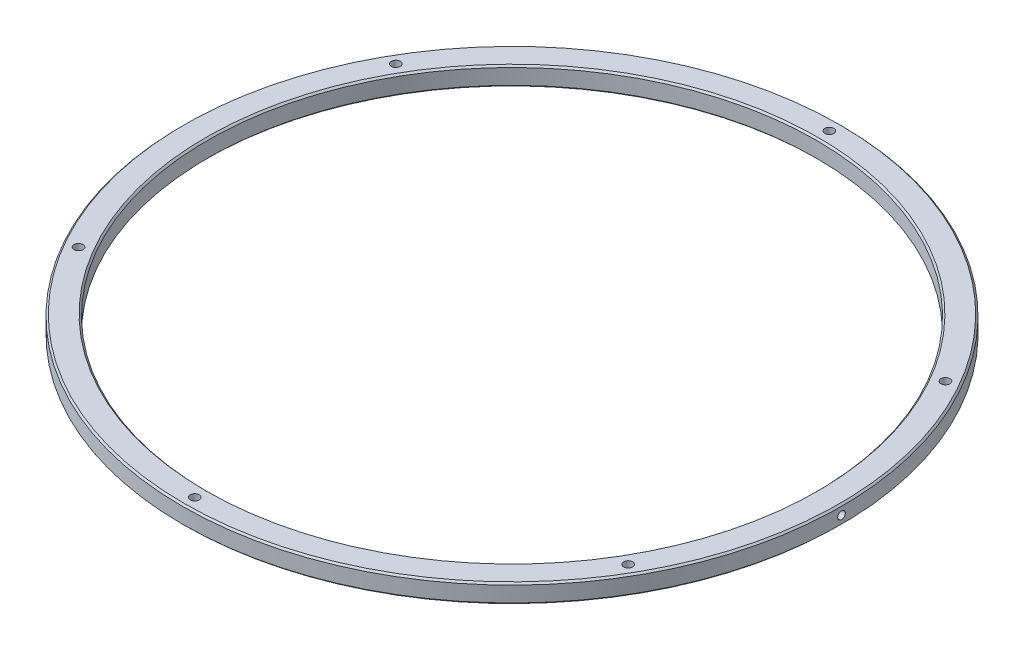
ISO-10303-21;
HEADER;
FILE_DESCRIPTION(('STEP AP214'),'2;1');
FILE_NAME('part.step','',(''),(''),'','','');
FILE_SCHEMA(('AUTOMOTIVE_DESIGN { 1 0 10303 214 1 1 1 1 }'));
ENDSEC;
DATA;
#1=APPLICATION_CONTEXT('core data for automotive mechanical design processes');
#2=APPLICATION_PROTOCOL_DEFINITION('international standard','automotive_design',2000,#1);
#3=PRODUCT_CONTEXT('',#1,'mechanical');
#4=PRODUCT('Part','Part','',(#3));
#5=PRODUCT_RELATED_PRODUCT_CATEGORY('part','',(#4));
#6=PRODUCT_DEFINITION_FORMATION('','',#4);
#7=PRODUCT_DEFINITION_CONTEXT('part definition',#1,'design');
#8=PRODUCT_DEFINITION('design','',#6,#7);
#9=PRODUCT_DEFINITION_SHAPE('','',#8);
#10=(LENGTH_UNIT() NAMED_UNIT(*) SI_UNIT(.MILLI.,.METRE.));
#11=(NAMED_UNIT(*) PLANE_ANGLE_UNIT() SI_UNIT($,.RADIAN.));
#12=(NAMED_UNIT(*) SI_UNIT($,.STERADIAN.) SOLID_ANGLE_UNIT());
#13=UNCERTAINTY_MEASURE_WITH_UNIT(LENGTH_MEASURE(1.E-05),#10,'distance_accuracy_value','');
#14=(GEOMETRIC_REPRESENTATION_CONTEXT(3) GLOBAL_UNCERTAINTY_ASSIGNED_CONTEXT((#13)) GLOBAL_UNIT_ASSIGNED_CONTEXT((#10,
#11,#12)) REPRESENTATION_CONTEXT('',''));
#15=CARTESIAN_POINT('',(0.,0.,0.));
#16=DIRECTION('',(0.,0.,1.));
#17=DIRECTION('',(1.,0.,0.));
#18=AXIS2_PLACEMENT_3D('',#15,#16,#17);
#19=CARTESIAN_POINT('',(0.,10.,0.));
#20=DIRECTION('',(0.,-1.,0.));
#21=DIRECTION('',(0.,0.,-1.));
#22=AXIS2_PLACEMENT_3D('',#19,#20,#21);
#23=CYLINDRICAL_SURFACE('',#22,175.);
#24=CARTESIAN_POINT('',(0.,0.888999999999973,0.));
#25=DIRECTION('',(0.,1.,0.));
#26=DIRECTION('',(0.,0.,1.));
#27=AXIS2_PLACEMENT_3D('',#24,#25,#26);
#28=CIRCLE('',#27,175.);
#29=CARTESIAN_POINT('',(0.,0.888999999999973,175.));
#30=VERTEX_POINT('',#29);
#31=EDGE_CURVE('E10',#30,#30,#28,.T.);
#32=ORIENTED_EDGE('',*,*,#31,.T.);
#33=EDGE_LOOP('',(#32));
#34=FACE_BOUND('',#33,.T.);
#35=CARTESIAN_POINT('',(0.,9.11100000000003,0.));
#36=DIRECTION('',(0.,1.,0.));
#37=DIRECTION('',(0.,0.,1.));
#38=AXIS2_PLACEMENT_3D('',#35,#36,#37);
#39=CIRCLE('',#38,175.);
#40=CARTESIAN_POINT('',(0.,9.11100000000003,-175.));
#41=VERTEX_POINT('',#40);
#42=EDGE_CURVE('E51',#41,#41,#39,.F.);
#43=ORIENTED_EDGE('',*,*,#42,.T.);
#44=EDGE_LOOP('',(#43));
#45=FACE_BOUND('',#44,.T.);
#46=CARTESIAN_POINT('',(174.98820239238,4.99928134064787,-2.03199987291553));
#47=CARTESIAN_POINT('',(174.988202570209,4.88479531172114,-2.03199365923341));
#48=CARTESIAN_POINT('',(174.988321210938,4.77023251183511,-2.02184241964528));
#49=CARTESIAN_POINT('',(174.988771961684,4.54427467390271,-1.98243708763626));
#50=CARTESIAN_POINT('',(174.98910454192,4.43288717945389,-1.95314091408695));
#51=CARTESIAN_POINT('',(174.989941765229,4.21664529370118,-1.87663009054582));
#52=CARTESIAN_POINT('',(174.990446146028,4.11178123053976,-1.82944274109848));
#53=CARTESIAN_POINT('',(174.991572227382,3.91138486214241,-1.71834747851327));
#54=CARTESIAN_POINT('',(174.992193793931,3.81584208519371,-1.65445863223467));
#55=CARTESIAN_POINT('',(174.99316705951,3.68135003597958,-1.54686159015817));
#56=CARTESIAN_POINT('',(174.993500152058,3.63778542503404,-1.5088048170447));
#57=CARTESIAN_POINT('',(174.994170036959,3.55417760604364,-1.42900315304231));
#58=CARTESIAN_POINT('',(174.994506829248,3.51413433792167,-1.38725832509912));
#59=CARTESIAN_POINT('',(174.995507056759,3.39969346954507,-1.25698561559439));
#60=CARTESIAN_POINT('',(174.996160655738,3.33094352858026,-1.16338638576851));
#61=CARTESIAN_POINT('',(174.997343785933,3.21197657746896,-0.968949344246464));
#62=CARTESIAN_POINT('',(174.997876379067,3.16127762878772,-0.868402177204877));
#63=CARTESIAN_POINT('',(174.998784832444,3.07673799937918,-0.660368849450822));
#64=CARTESIAN_POINT('',(174.999160689881,3.04289762033697,-0.552882564601315));
#65=CARTESIAN_POINT('',(174.99958205427,3.00519772124178,-0.386691740485421));
#66=CARTESIAN_POINT('',(174.999699492169,2.9947474844399,-0.329406812700526));
#67=CARTESIAN_POINT('',(174.9998784535,2.97882602162202,-0.214135140119631));
#68=CARTESIAN_POINT('',(174.999939980293,2.97335449638739,-0.156148437712286));
#69=CARTESIAN_POINT('',(175.000005086831,2.96755421319917,-0.0399459595556265));
#70=CARTESIAN_POINT('',(175.000008694774,2.96722295265631,0.0182696909179335));
#71=CARTESIAN_POINT('',(174.999957967073,2.97179896147085,0.134493870431488));
#72=CARTESIAN_POINT('',(174.999903631396,2.97670623386845,0.19250239935126));
#73=CARTESIAN_POINT('',(174.99974196756,2.99124004105372,0.305579832220002));
#74=CARTESIAN_POINT('',(174.999636829018,3.00067147107204,0.36067400748078));
#75=CARTESIAN_POINT('',(174.999377673265,3.02399673059137,0.469896537800808));
#76=CARTESIAN_POINT('',(174.999223655767,3.0378905863673,0.524024887171257));
#77=CARTESIAN_POINT('',(174.998693720698,3.08605613098121,0.684551753002757));
#78=CARTESIAN_POINT('',(174.998249952503,3.12680904830388,0.789071325159671));
#79=CARTESIAN_POINT('',(174.997205808091,3.22650591426776,0.994454532327489));
#80=CARTESIAN_POINT('',(174.99659972568,3.2861310492342,1.09498938919473));
#81=CARTESIAN_POINT('',(174.995635073546,3.38769308566503,1.23691603530736));
#82=CARTESIAN_POINT('',(174.995304308493,3.42356309391825,1.28274097883027));
#83=CARTESIAN_POINT('',(174.994634773728,3.49923268312198,1.37103769102855));
#84=CARTESIAN_POINT('',(174.994296004978,3.5390317928861,1.41350986067917));
#85=CARTESIAN_POINT('',(174.993629511773,3.62124717245,1.49372134065822));
#86=CARTESIAN_POINT('',(174.993301720397,3.6635751707496,1.53155126382363));
#87=CARTESIAN_POINT('',(174.992657320357,3.75127024105599,1.60348850065141));
#88=CARTESIAN_POINT('',(174.992340712799,3.79663761204991,1.63759544720933));
#89=CARTESIAN_POINT('',(174.991419874102,3.93686685571029,1.73410688135205));
#90=CARTESIAN_POINT('',(174.990844783648,4.03583715737115,1.79068386409452));
#91=CARTESIAN_POINT('',(174.98983192862,4.24204865375978,1.88707742775803));
#92=CARTESIAN_POINT('',(174.989394751567,4.34932287231249,1.92682254303988));
#93=CARTESIAN_POINT('',(174.988710226764,4.56895990518529,1.98802557957096));
#94=CARTESIAN_POINT('',(174.98846270593,4.6813179804679,2.00950017675126));
#95=CARTESIAN_POINT('',(174.988257173056,4.85201395639353,2.02728171498364));
#96=CARTESIAN_POINT('',(174.988216595273,4.90967828219293,2.03077672020764));
#97=CARTESIAN_POINT('',(174.98819447176,5.02509110364189,2.03268198510316));
#98=CARTESIAN_POINT('',(174.988212925491,5.08283959851632,2.03109229130902));
#99=CARTESIAN_POINT('',(174.988355753599,5.25557714957616,2.01877561547303));
#100=CARTESIAN_POINT('',(174.988567536179,5.37010778184744,2.00050610776576));
#101=CARTESIAN_POINT('',(174.989184259815,5.59132945514331,1.94578958326098));
#102=CARTESIAN_POINT('',(174.989583786324,5.69814902972441,1.90985088128677));
#103=CARTESIAN_POINT('',(174.990528674178,5.90458319030026,1.82121900058679));
#104=CARTESIAN_POINT('',(174.991074025107,6.00419829018412,1.76852701830801));
#105=CARTESIAN_POINT('',(174.992276348689,6.19692837471479,1.64533660114592));
#106=CARTESIAN_POINT('',(174.992936607636,6.28968501260456,1.57427031859738));
#107=CARTESIAN_POINT('',(174.993944361538,6.41826787717164,1.45635748449379));
#108=CARTESIAN_POINT('',(174.994283271507,6.45938022645378,1.41515445805689));
#109=CARTESIAN_POINT('',(174.994956743324,6.5377979066013,1.32927150113451));
#110=CARTESIAN_POINT('',(174.995291305039,6.57510312237866,1.28459146561247));
#111=CARTESIAN_POINT('',(174.996248386346,6.67844408619214,1.14932426752016));
#112=CARTESIAN_POINT('',(174.996850666145,6.73909474521977,1.054540290491));
#113=CARTESIAN_POINT('',(174.997932587279,6.8442792182308,0.856400700453925));
#114=CARTESIAN_POINT('',(174.998412132736,6.88880044325392,0.753038469150343));
#115=CARTESIAN_POINT('',(174.999210577482,6.96176199306666,0.536964713177678));
#116=CARTESIAN_POINT('',(174.999523700867,6.98962787711477,0.424057856247075));
#117=CARTESIAN_POINT('',(174.999928436711,7.02563245802375,0.195218692623221));
#118=CARTESIAN_POINT('',(175.00002028153,7.03379184833555,0.0792896888947458));
#119=CARTESIAN_POINT('',(174.99997260007,7.02957404256514,-0.149913062620454));
#120=CARTESIAN_POINT('',(174.999837560021,7.01759504328081,-0.263194428542191));
#121=CARTESIAN_POINT('',(174.999360001172,6.97496827173031,-0.486276424088285));
#122=CARTESIAN_POINT('',(174.999017252512,6.94429981658459,-0.596073055466022));
#123=CARTESIAN_POINT('',(174.998160118531,6.86532386841745,-0.809570049710768));
#124=CARTESIAN_POINT('',(174.997645101535,6.81695139557708,-0.913246299604544));
#125=CARTESIAN_POINT('',(174.996500179563,6.70378030865486,-1.11117189581382));
#126=CARTESIAN_POINT('',(174.995870387887,6.63899786934334,-1.2054303980608));
#127=CARTESIAN_POINT('',(174.994889550013,6.53007320344681,-1.33815027913542));
#128=CARTESIAN_POINT('',(174.9945538282,6.49145967167629,-1.381245381003));
#129=CARTESIAN_POINT('',(174.993882475156,6.41053290206212,-1.46383000323183));
#130=CARTESIAN_POINT('',(174.993546843922,6.36821978670842,-1.50331964287833));
#131=CARTESIAN_POINT('',(174.992885411739,6.28025063865243,-1.57843923556556));
#132=CARTESIAN_POINT('',(174.992559617862,6.23459227783856,-1.61406645697988));
#133=CARTESIAN_POINT('',(174.991926686455,6.14041027581037,-1.68128577081351));
#134=CARTESIAN_POINT('',(174.991619550126,6.09188645028422,-1.71287760325506));
#135=CARTESIAN_POINT('',(174.9907580327,5.94592068830775,-1.79940857291377));
#136=CARTESIAN_POINT('',(174.990240008058,5.84503636296602,-1.84866569100735));
#137=CARTESIAN_POINT('',(174.989357133785,5.63684519443047,-1.93043268311156));
#138=CARTESIAN_POINT('',(174.988992103033,5.52954611830843,-1.96296237019446));
#139=CARTESIAN_POINT('',(174.98855423983,5.3512181421963,-2.00152324765041));
#140=CARTESIAN_POINT('',(174.988423346514,5.28131221847808,-2.01289688540128));
#141=CARTESIAN_POINT('',(174.988247384998,5.1407075248009,-2.02813561795394));
#142=CARTESIAN_POINT('',(174.98820228252,5.07000908285774,-2.03200371163464));
#143=CARTESIAN_POINT('',(174.98820239238,4.99928134064787,-2.03199987291553));
#144=B_SPLINE_CURVE_WITH_KNOTS('',3,(#46,#47,#48,#49,#50,#51,#52,#53,#54,#55,#56,#57,#58,#59,
#60,#61,#62,#63,#64,#65,#66,#67,#68,#69,#70,#71,#72,#73,#74,#75,#76,#77,#78,#79,#80,#81,#82,#83,
#84,#85,#86,#87,#88,#89,#90,#91,#92,#93,#94,#95,#96,#97,#98,#99,#100,#101,#102,#103,#104,#105,
#106,#107,#108,#109,#110,#111,#112,#113,#114,#115,#116,#117,#118,#119,#120,#121,#122,#123,#124,
#125,#126,#127,#128,#129,#130,#131,#132,#133,#134,#135,#136,#137,#138,#139,#140,#141,#142,#143),
.UNSPECIFIED.,.T.,.F.,(4,2,2,2,2,2,2,2,2,2,2,2,2,2,2,2,2,2,2,2,2,2,2,2,2,2,2,2,2,2,2,2,2,2,2,2,
2,2,2,2,2,2,2,2,2,2,2,2,4),(0.,0.343203024374381,0.687162967972575,1.03060015406831,
1.3736469627809,1.54699333720159,1.72033675361126,2.06686700732383,2.4032929940128,
2.7397250008482,2.91423781342216,3.08874013715112,3.26315750001154,3.43757496409544,
3.60506751717012,3.77256105646538,4.10761022604327,4.45648356128204,4.63088091774184,
4.80525738543826,4.97535164454954,5.14546266069829,5.48576179674183,5.82749164887424,
6.16890926050828,6.34202601661064,6.51514118838096,6.86122428458129,7.19788724027286,
7.53452615834732,7.88316661460126,8.0575849727224,8.23200860187507,8.5679538475351,
8.90416073512244,9.25137909667569,9.59823269135521,9.93830829930205,10.2787609406056,
10.6204759008233,10.9618553454969,11.1352588155618,11.3086565465628,11.4821761208346,
11.6557068683789,11.9909696559526,12.3258344161332,12.5379448363353,12.749970489257),.UNSPECIFIED.);
#145=CARTESIAN_POINT('',(174.98820239238,4.99928134064787,-2.03199987291553));
#146=VERTEX_POINT('',#145);
#147=EDGE_CURVE('E84',#146,#146,#144,.F.);
#148=ORIENTED_EDGE('',*,*,#147,.F.);
#149=EDGE_LOOP('',(#148));
#150=FACE_BOUND('',#149,.T.);
#151=ADVANCED_FACE('F42',(#34,#45,#150),#23,.T.);
#152=CARTESIAN_POINT('',(0.,10.,0.));
#153=DIRECTION('',(0.,1.,0.));
#154=DIRECTION('',(0.,0.,1.));
#155=AXIS2_PLACEMENT_3D('',#152,#153,#154);
#156=PLANE('',#155);
#157=CARTESIAN_POINT('',(0.,10.,0.));
#158=DIRECTION('',(0.,1.,0.));
#159=DIRECTION('',(0.,0.,1.));
#160=AXIS2_PLACEMENT_3D('',#157,#158,#159);
#161=CIRCLE('',#160,162.554);
#162=CARTESIAN_POINT('',(0.,10.,162.554));
#163=VERTEX_POINT('',#162);
#164=EDGE_CURVE('E56',#163,#163,#161,.F.);
#165=ORIENTED_EDGE('',*,*,#164,.T.);
#166=EDGE_LOOP('',(#165));
#167=FACE_BOUND('',#166,.T.);
#168=CARTESIAN_POINT('',(0.,10.,0.));
#169=DIRECTION('',(0.,1.,0.));
#170=DIRECTION('',(0.,0.,1.));
#171=AXIS2_PLACEMENT_3D('',#168,#169,#170);
#172=CIRCLE('',#171,174.111);
#173=CARTESIAN_POINT('',(0.,10.,-174.111));
#174=VERTEX_POINT('',#173);
#175=EDGE_CURVE('E61',#174,#174,#172,.T.);
#176=ORIENTED_EDGE('',*,*,#175,.T.);
#177=EDGE_LOOP('',(#176));
#178=FACE_BOUND('',#177,.T.);
#179=CARTESIAN_POINT('',(-145.925280537693,10.,84.2499999999739));
#180=DIRECTION('',(0.,1.,0.));
#181=DIRECTION('',(0.,0.,1.));
#182=AXIS2_PLACEMENT_3D('',#179,#180,#181);
#183=CIRCLE('',#182,2.38124999997265);
#184=CARTESIAN_POINT('',(-145.925280537693,10.,86.6312499999465));
#185=VERTEX_POINT('',#184);
#186=EDGE_CURVE('E169',#185,#185,#183,.T.);
#187=ORIENTED_EDGE('',*,*,#186,.F.);
#188=EDGE_LOOP('',(#187));
#189=FACE_BOUND('',#188,.T.);
#190=CARTESIAN_POINT('',(145.92528053767,10.,84.2500000000131));
#191=DIRECTION('',(0.,1.,0.));
#192=DIRECTION('',(0.,0.,1.));
#193=AXIS2_PLACEMENT_3D('',#190,#191,#192);
#194=CIRCLE('',#193,2.38124999998634);
#195=CARTESIAN_POINT('',(145.92528053767,10.,86.6312499999994));
#196=VERTEX_POINT('',#195);
#197=EDGE_CURVE('E181',#196,#196,#194,.T.);
#198=ORIENTED_EDGE('',*,*,#197,.F.);
#199=EDGE_LOOP('',(#198));
#200=FACE_BOUND('',#199,.T.);
#201=CARTESIAN_POINT('',(0.,10.,-168.5));
#202=DIRECTION('',(0.,1.,0.));
#203=DIRECTION('',(0.,0.,1.));
#204=AXIS2_PLACEMENT_3D('',#201,#202,#203);
#205=CIRCLE('',#204,2.38125);
#206=CARTESIAN_POINT('',(0.,10.,-166.11875));
#207=VERTEX_POINT('',#206);
#208=EDGE_CURVE('E83',#207,#207,#205,.T.);
#209=ORIENTED_EDGE('',*,*,#208,.F.);
#210=EDGE_LOOP('',(#209));
#211=FACE_BOUND('',#210,.T.);
#212=CARTESIAN_POINT('',(145.925280537682,10.,-84.2499999999935));
#213=DIRECTION('',(0.,1.,0.));
#214=DIRECTION('',(0.,0.,1.));
#215=AXIS2_PLACEMENT_3D('',#212,#213,#214);
#216=CIRCLE('',#215,2.38124999999314);
#217=CARTESIAN_POINT('',(145.925280537682,10.,-81.8687500000003));
#218=VERTEX_POINT('',#217);
#219=EDGE_CURVE('E187',#218,#218,#216,.T.);
#220=ORIENTED_EDGE('',*,*,#219,.F.);
#221=EDGE_LOOP('',(#220));
#222=FACE_BOUND('',#221,.T.);
#223=CARTESIAN_POINT('',(-2.25777323230745E-11,10.,168.5));
#224=DIRECTION('',(0.,1.,0.));
#225=DIRECTION('',(0.,0.,1.));
#226=AXIS2_PLACEMENT_3D('',#223,#224,#225);
#227=CIRCLE('',#226,2.38124999997953);
#228=CARTESIAN_POINT('',(-2.25777323230745E-11,10.,170.88124999998));
#229=VERTEX_POINT('',#228);
#230=EDGE_CURVE('E175',#229,#229,#227,.T.);
#231=ORIENTED_EDGE('',*,*,#230,.F.);
#232=EDGE_LOOP('',(#231));
#233=FACE_BOUND('',#232,.T.);
#234=CARTESIAN_POINT('',(-145.925280537659,10.,-84.2500000000327));
#235=DIRECTION('',(0.,1.,0.));
#236=DIRECTION('',(0.,0.,1.));
#237=AXIS2_PLACEMENT_3D('',#234,#235,#236);
#238=CIRCLE('',#237,2.38124999996578);
#239=CARTESIAN_POINT('',(-145.925280537659,10.,-81.8687500000669));
#240=VERTEX_POINT('',#239);
#241=EDGE_CURVE('E162',#240,#240,#238,.T.);
#242=ORIENTED_EDGE('',*,*,#241,.F.);
#243=EDGE_LOOP('',(#242));
#244=FACE_BOUND('',#243,.T.);
#245=ADVANCED_FACE('F105',(#167,#178,#189,#200,#211,#222,#233,#244),#156,.T.);
#246=CARTESIAN_POINT('',(0.,0.,0.));
#247=DIRECTION('',(0.,1.,0.));
#248=DIRECTION('',(0.,0.,1.));
#249=AXIS2_PLACEMENT_3D('',#246,#247,#248);
#250=PLANE('',#249);
#251=CARTESIAN_POINT('',(0.,0.,0.));
#252=DIRECTION('',(0.,1.,0.));
#253=DIRECTION('',(0.,0.,1.));
#254=AXIS2_PLACEMENT_3D('',#251,#252,#253);
#255=CIRCLE('',#254,162.554);
#256=CARTESIAN_POINT('',(0.,0.,-162.554));
#257=VERTEX_POINT('',#256);
#258=EDGE_CURVE('E75',#257,#257,#255,.T.);
#259=ORIENTED_EDGE('',*,*,#258,.T.);
#260=EDGE_LOOP('',(#259));
#261=FACE_BOUND('',#260,.T.);
#262=CARTESIAN_POINT('',(0.,0.,0.));
#263=DIRECTION('',(0.,1.,0.));
#264=DIRECTION('',(0.,0.,1.));
#265=AXIS2_PLACEMENT_3D('',#262,#263,#264);
#266=CIRCLE('',#265,174.111);
#267=CARTESIAN_POINT('',(0.,0.,174.111));
#268=VERTEX_POINT('',#267);
#269=EDGE_CURVE('E79',#268,#268,#266,.F.);
#270=ORIENTED_EDGE('',*,*,#269,.T.);
#271=EDGE_LOOP('',(#270));
#272=FACE_BOUND('',#271,.T.);
#273=CARTESIAN_POINT('',(0.,0.,-168.5));
#274=DIRECTION('',(0.,1.,0.));
#275=DIRECTION('',(0.,0.,1.));
#276=AXIS2_PLACEMENT_3D('',#273,#274,#275);
#277=CIRCLE('',#276,2.38125);
#278=CARTESIAN_POINT('',(0.,0.,-166.11875));
#279=VERTEX_POINT('',#278);
#280=EDGE_CURVE('E95',#279,#279,#277,.T.);
#281=ORIENTED_EDGE('',*,*,#280,.T.);
#282=EDGE_LOOP('',(#281));
#283=FACE_BOUND('',#282,.T.);
#284=CARTESIAN_POINT('',(145.925280537682,0.,-84.2499999999935));
#285=DIRECTION('',(0.,1.,0.));
#286=DIRECTION('',(0.,0.,1.));
#287=AXIS2_PLACEMENT_3D('',#284,#285,#286);
#288=CIRCLE('',#287,2.38124999999314);
#289=CARTESIAN_POINT('',(145.925280537682,0.,-81.8687500000003));
#290=VERTEX_POINT('',#289);
#291=EDGE_CURVE('E145',#290,#290,#288,.T.);
#292=ORIENTED_EDGE('',*,*,#291,.T.);
#293=EDGE_LOOP('',(#292));
#294=FACE_BOUND('',#293,.T.);
#295=CARTESIAN_POINT('',(145.92528053767,0.,84.2500000000131));
#296=DIRECTION('',(0.,1.,0.));
#297=DIRECTION('',(0.,0.,1.));
#298=AXIS2_PLACEMENT_3D('',#295,#296,#297);
#299=CIRCLE('',#298,2.38124999998634);
#300=CARTESIAN_POINT('',(145.92528053767,0.,86.6312499999994));
#301=VERTEX_POINT('',#300);
#302=EDGE_CURVE('E149',#301,#301,#299,.T.);
#303=ORIENTED_EDGE('',*,*,#302,.T.);
#304=EDGE_LOOP('',(#303));
#305=FACE_BOUND('',#304,.T.);
#306=CARTESIAN_POINT('',(-2.25777323230745E-11,0.,168.5));
#307=DIRECTION('',(0.,1.,0.));
#308=DIRECTION('',(0.,0.,1.));
#309=AXIS2_PLACEMENT_3D('',#306,#307,#308);
#310=CIRCLE('',#309,2.38124999997953);
#311=CARTESIAN_POINT('',(-2.25777323230745E-11,0.,170.88124999998));
#312=VERTEX_POINT('',#311);
#313=EDGE_CURVE('E153',#312,#312,#310,.T.);
#314=ORIENTED_EDGE('',*,*,#313,.T.);
#315=EDGE_LOOP('',(#314));
#316=FACE_BOUND('',#315,.T.);
#317=CARTESIAN_POINT('',(-145.925280537693,0.,84.2499999999739));
#318=DIRECTION('',(0.,1.,0.));
#319=DIRECTION('',(0.,0.,1.));
#320=AXIS2_PLACEMENT_3D('',#317,#318,#319);
#321=CIRCLE('',#320,2.38124999997265);
#322=CARTESIAN_POINT('',(-145.925280537693,0.,86.6312499999465));
#323=VERTEX_POINT('',#322);
#324=EDGE_CURVE('E157',#323,#323,#321,.T.);
#325=ORIENTED_EDGE('',*,*,#324,.T.);
#326=EDGE_LOOP('',(#325));
#327=FACE_BOUND('',#326,.T.);
#328=CARTESIAN_POINT('',(-145.925280537659,0.,-84.2500000000327));
#329=DIRECTION('',(0.,1.,0.));
#330=DIRECTION('',(0.,0.,1.));
#331=AXIS2_PLACEMENT_3D('',#328,#329,#330);
#332=CIRCLE('',#331,2.38124999996578);
#333=CARTESIAN_POINT('',(-145.925280537659,0.,-81.8687500000669));
#334=VERTEX_POINT('',#333);
#335=EDGE_CURVE('E93',#334,#334,#332,.T.);
#336=ORIENTED_EDGE('',*,*,#335,.T.);
#337=EDGE_LOOP('',(#336));
#338=FACE_BOUND('',#337,.T.);
#339=ADVANCED_FACE('F106',(#261,#272,#283,#294,#305,#316,#327,#338),#250,.F.);
#340=CARTESIAN_POINT('',(0.,10.,0.));
#341=DIRECTION('',(0.,-1.,0.));
#342=DIRECTION('',(0.,0.,-1.));
#343=AXIS2_PLACEMENT_3D('',#340,#341,#342);
#344=CYLINDRICAL_SURFACE('',#343,161.665);
#345=CARTESIAN_POINT('',(0.,0.888999999999973,0.));
#346=DIRECTION('',(0.,1.,0.));
#347=DIRECTION('',(0.,0.,1.));
#348=AXIS2_PLACEMENT_3D('',#345,#346,#347);
#349=CIRCLE('',#348,161.665);
#350=CARTESIAN_POINT('',(0.,0.888999999999973,-161.665));
#351=VERTEX_POINT('',#350);
#352=EDGE_CURVE('E67',#351,#351,#349,.F.);
#353=ORIENTED_EDGE('',*,*,#352,.T.);
#354=EDGE_LOOP('',(#353));
#355=FACE_BOUND('',#354,.T.);
#356=CARTESIAN_POINT('',(0.,9.111,0.));
#357=DIRECTION('',(0.,1.,0.));
#358=DIRECTION('',(0.,0.,1.));
#359=AXIS2_PLACEMENT_3D('',#356,#357,#358);
#360=CIRCLE('',#359,161.665);
#361=CARTESIAN_POINT('',(0.,9.111,161.665));
#362=VERTEX_POINT('',#361);
#363=EDGE_CURVE('E71',#362,#362,#360,.T.);
#364=ORIENTED_EDGE('',*,*,#363,.T.);
#365=EDGE_LOOP('',(#364));
#366=FACE_BOUND('',#365,.T.);
#367=ADVANCED_FACE('F137',(#355,#366),#344,.F.);
#368=CARTESIAN_POINT('',(0.,10.,-168.5));
#369=DIRECTION('',(0.,-1.,0.));
#370=DIRECTION('',(0.,0.,-1.));
#371=AXIS2_PLACEMENT_3D('',#368,#369,#370);
#372=CYLINDRICAL_SURFACE('',#371,2.38125);
#373=ORIENTED_EDGE('',*,*,#208,.T.);
#374=EDGE_LOOP('',(#373));
#375=FACE_BOUND('',#374,.T.);
#376=ORIENTED_EDGE('',*,*,#280,.F.);
#377=EDGE_LOOP('',(#376));
#378=FACE_BOUND('',#377,.T.);
#379=ADVANCED_FACE('F197',(#375,#378),#372,.F.);
#380=CARTESIAN_POINT('',(145.925280537682,10.,-84.2499999999935));
#381=DIRECTION('',(0.,-1.,0.));
#382=DIRECTION('',(0.,0.,-1.));
#383=AXIS2_PLACEMENT_3D('',#380,#381,#382);
#384=CYLINDRICAL_SURFACE('',#383,2.38124999999314);
#385=ORIENTED_EDGE('',*,*,#219,.T.);
#386=EDGE_LOOP('',(#385));
#387=FACE_BOUND('',#386,.T.);
#388=ORIENTED_EDGE('',*,*,#291,.F.);
#389=EDGE_LOOP('',(#388));
#390=FACE_BOUND('',#389,.T.);
#391=ADVANCED_FACE('F333',(#387,#390),#384,.F.);
#392=CARTESIAN_POINT('',(145.92528053767,10.,84.2500000000131));
#393=DIRECTION('',(0.,-1.,0.));
#394=DIRECTION('',(0.,0.,-1.));
#395=AXIS2_PLACEMENT_3D('',#392,#393,#394);
#396=CYLINDRICAL_SURFACE('',#395,2.38124999998634);
#397=ORIENTED_EDGE('',*,*,#197,.T.);
#398=EDGE_LOOP('',(#397));
#399=FACE_BOUND('',#398,.T.);
#400=ORIENTED_EDGE('',*,*,#302,.F.);
#401=EDGE_LOOP('',(#400));
#402=FACE_BOUND('',#401,.T.);
#403=ADVANCED_FACE('F323',(#399,#402),#396,.F.);
#404=CARTESIAN_POINT('',(-2.25777323230745E-11,10.,168.5));
#405=DIRECTION('',(0.,-1.,0.));
#406=DIRECTION('',(0.,0.,-1.));
#407=AXIS2_PLACEMENT_3D('',#404,#405,#406);
#408=CYLINDRICAL_SURFACE('',#407,2.38124999997953);
#409=ORIENTED_EDGE('',*,*,#230,.T.);
#410=EDGE_LOOP('',(#409));
#411=FACE_BOUND('',#410,.T.);
#412=ORIENTED_EDGE('',*,*,#313,.F.);
#413=EDGE_LOOP('',(#412));
#414=FACE_BOUND('',#413,.T.);
#415=ADVANCED_FACE('F218',(#411,#414),#408,.F.);
#416=CARTESIAN_POINT('',(-145.925280537693,10.,84.2499999999739));
#417=DIRECTION('',(0.,-1.,0.));
#418=DIRECTION('',(0.,0.,-1.));
#419=AXIS2_PLACEMENT_3D('',#416,#417,#418);
#420=CYLINDRICAL_SURFACE('',#419,2.38124999997265);
#421=ORIENTED_EDGE('',*,*,#186,.T.);
#422=EDGE_LOOP('',(#421));
#423=FACE_BOUND('',#422,.T.);
#424=ORIENTED_EDGE('',*,*,#324,.F.);
#425=EDGE_LOOP('',(#424));
#426=FACE_BOUND('',#425,.T.);
#427=ADVANCED_FACE('F211',(#423,#426),#420,.F.);
#428=CARTESIAN_POINT('',(-145.925280537659,10.,-84.2500000000327));
#429=DIRECTION('',(0.,-1.,0.));
#430=DIRECTION('',(0.,0.,-1.));
#431=AXIS2_PLACEMENT_3D('',#428,#429,#430);
#432=CYLINDRICAL_SURFACE('',#431,2.38124999996578);
#433=ORIENTED_EDGE('',*,*,#241,.T.);
#434=EDGE_LOOP('',(#433));
#435=FACE_BOUND('',#434,.T.);
#436=ORIENTED_EDGE('',*,*,#335,.F.);
#437=EDGE_LOOP('',(#436));
#438=FACE_BOUND('',#437,.T.);
#439=ADVANCED_FACE('F209',(#435,#438),#432,.F.);
#440=CARTESIAN_POINT('',(-3.81,10.,0.));
#441=DIRECTION('',(0.,-1.,0.));
#442=DIRECTION('',(0.,0.,-1.));
#443=AXIS2_PLACEMENT_3D('',#440,#441,#442);
#444=CYLINDRICAL_SURFACE('',#443,175.);
#445=CARTESIAN_POINT('',(171.178202390904,5.,2.032));
#446=CARTESIAN_POINT('',(171.178202390904,5.53698009607463,2.032));
#447=CARTESIAN_POINT('',(171.181029940026,6.06307687603614,1.81120354152492));
#448=CARTESIAN_POINT('',(171.18719149563,6.81289942666298,1.06018223999472));
#449=CARTESIAN_POINT('',(171.190006335644,7.03254563891442,0.533876496878615));
#450=CARTESIAN_POINT('',(171.189993639806,7.03145224677908,-0.538021985838506));
#451=CARTESIAN_POINT('',(171.187166507277,6.8105192822611,-1.06388855260903));
#452=CARTESIAN_POINT('',(171.181013185921,6.06037273207374,-1.81258064451937));
#453=CARTESIAN_POINT('',(171.178200213941,5.52971507728032,-2.03218747192604));
#454=CARTESIAN_POINT('',(171.178204570819,4.46884760401542,-2.03181227390502));
#455=CARTESIAN_POINT('',(171.180992775199,3.94155435458065,-1.81562455045172));
#456=CARTESIAN_POINT('',(171.187221901044,3.18329203845742,-1.05658500603502));
#457=CARTESIAN_POINT('',(171.190003266126,2.967718714499,-0.52899851848574));
#458=CARTESIAN_POINT('',(171.189996727217,2.96828185885613,0.531157275112163));
#459=CARTESIAN_POINT('',(171.187180869668,3.18812865702883,1.06174319201491));
#460=CARTESIAN_POINT('',(171.18102384125,3.93793105624951,1.81168041552335));
#461=CARTESIAN_POINT('',(171.178202390904,4.46301990392537,2.032));
#462=CARTESIAN_POINT('',(171.178202390904,5.,2.032));
#463=B_SPLINE_CURVE_WITH_KNOTS('',3,(#445,#446,#447,#448,#449,#450,#451,#452,#453,#454,#455,
#456,#457,#458,#459,#460,#461,#462),.UNSPECIFIED.,.T.,.F.,(4,2,2,2,2,2,2,2,4),(0.,0.125,0.25,
0.375,0.5,0.625,0.75,0.875,1.),.UNSPECIFIED.);
#464=CARTESIAN_POINT('',(171.178202390904,5.,2.032));
#465=VERTEX_POINT('',#464);
#466=EDGE_CURVE('E94',#465,#465,#463,.F.);
#467=ORIENTED_EDGE('',*,*,#466,.T.);
#468=EDGE_LOOP('',(#467));
#469=FACE_BOUND('',#468,.T.);
#470=ADVANCED_FACE('F117',(#469),#444,.T.);
#471=CARTESIAN_POINT('',(174.988202390904,5.,2.032));
#472=CARTESIAN_POINT('',(174.988202390904,4.46301990392537,2.032));
#473=CARTESIAN_POINT('',(174.99102384125,3.93793105624951,1.81168041552335));
#474=CARTESIAN_POINT('',(174.997180869668,3.18812865702883,1.06174319201491));
#475=CARTESIAN_POINT('',(174.999996727217,2.96828185885613,0.531157275112163));
#476=CARTESIAN_POINT('',(175.000003266126,2.967718714499,-0.52899851848574));
#477=CARTESIAN_POINT('',(174.997221901043,3.18329203845742,-1.05658500603502));
#478=CARTESIAN_POINT('',(174.990992775199,3.94155435458065,-1.81562455045172));
#479=CARTESIAN_POINT('',(174.988204570819,4.46884760401542,-2.03181227390502));
#480=CARTESIAN_POINT('',(174.988200213941,5.52971507728032,-2.03218747192604));
#481=CARTESIAN_POINT('',(174.991013185921,6.06037273207374,-1.81258064451937));
#482=CARTESIAN_POINT('',(174.997166507277,6.8105192822611,-1.06388855260903));
#483=CARTESIAN_POINT('',(174.999993639806,7.03145224677908,-0.538021985838506));
#484=CARTESIAN_POINT('',(175.000006335644,7.03254563891442,0.533876496878615));
#485=CARTESIAN_POINT('',(174.99719149563,6.81289942666298,1.06018223999472));
#486=CARTESIAN_POINT('',(174.991029940026,6.06307687603614,1.81120354152492));
#487=CARTESIAN_POINT('',(174.988202390904,5.53698009607463,2.032));
#488=CARTESIAN_POINT('',(174.988202390904,5.,2.032));
#489=B_SPLINE_CURVE_WITH_KNOTS('',3,(#471,#472,#473,#474,#475,#476,#477,#478,#479,#480,#481,
#482,#483,#484,#485,#486,#487,#488),.UNSPECIFIED.,.T.,.F.,(4,2,2,2,2,2,2,2,4),(0.,0.125,0.25,
0.375,0.5,0.625,0.75,0.875,1.),.UNSPECIFIED.);
#490=DIRECTION('',(-1.,0.,0.));
#491=VECTOR('',#490,1.);
#492=SURFACE_OF_LINEAR_EXTRUSION('',#489,#491);
#493=ORIENTED_EDGE('',*,*,#466,.F.);
#494=EDGE_LOOP('',(#493));
#495=FACE_BOUND('',#494,.T.);
#496=ORIENTED_EDGE('',*,*,#147,.T.);
#497=EDGE_LOOP('',(#496));
#498=FACE_BOUND('',#497,.T.);
#499=ADVANCED_FACE('F97',(#495,#498),#492,.T.);
#500=CARTESIAN_POINT('',(0.,0.,0.));
#501=DIRECTION('',(0.,-1.,0.));
#502=DIRECTION('',(0.,0.,-1.));
#503=AXIS2_PLACEMENT_3D('',#500,#501,#502);
#504=CONICAL_SURFACE('',#503,162.554,0.785398163397448);
#505=CARTESIAN_POINT('',(0.,0.888999999999973,-161.665));
#506=CARTESIAN_POINT('',(0.,0.879739583333307,-161.674260416667));
#507=CARTESIAN_POINT('',(0.,0.87047916666664,-161.683520833333));
#508=CARTESIAN_POINT('',(0.,0.851958333333308,-161.702041666667));
#509=CARTESIAN_POINT('',(0.,0.842697916666641,-161.711302083333));
#510=CARTESIAN_POINT('',(0.,0.824177083333308,-161.729822916667));
#511=CARTESIAN_POINT('',(0.,0.814916666666642,-161.739083333333));
#512=CARTESIAN_POINT('',(0.,0.796395833333309,-161.757604166667));
#513=CARTESIAN_POINT('',(0.,0.787135416666643,-161.766864583333));
#514=CARTESIAN_POINT('',(0.,0.76861458333331,-161.785385416667));
#515=CARTESIAN_POINT('',(0.,0.759354166666644,-161.794645833333));
#516=CARTESIAN_POINT('',(0.,0.740833333333311,-161.813166666667));
#517=CARTESIAN_POINT('',(0.,0.731572916666644,-161.822427083333));
#518=CARTESIAN_POINT('',(0.,0.713052083333312,-161.840947916667));
#519=CARTESIAN_POINT('',(0.,0.703791666666646,-161.850208333333));
#520=CARTESIAN_POINT('',(0.,0.685270833333312,-161.868729166667));
#521=CARTESIAN_POINT('',(0.,0.676010416666643,-161.877989583333));
#522=CARTESIAN_POINT('',(0.,0.657489583333312,-161.896510416667));
#523=CARTESIAN_POINT('',(0.,0.648229166666649,-161.905770833333));
#524=CARTESIAN_POINT('',(0.,0.629708333333317,-161.924291666667));
#525=CARTESIAN_POINT('',(0.,0.620447916666649,-161.933552083333));
#526=CARTESIAN_POINT('',(0.,0.601927083333314,-161.952072916667));
#527=CARTESIAN_POINT('',(0.,0.592666666666648,-161.961333333333));
#528=CARTESIAN_POINT('',(0.,0.574145833333316,-161.979854166667));
#529=CARTESIAN_POINT('',(0.,0.564885416666649,-161.989114583333));
#530=CARTESIAN_POINT('',(0.,0.546364583333317,-162.007635416667));
#531=CARTESIAN_POINT('',(0.,0.53710416666665,-162.016895833333));
#532=CARTESIAN_POINT('',(0.,0.518583333333318,-162.035416666667));
#533=CARTESIAN_POINT('',(0.,0.509322916666651,-162.044677083333));
#534=CARTESIAN_POINT('',(0.,0.490802083333318,-162.063197916667));
#535=CARTESIAN_POINT('',(0.,0.481541666666652,-162.072458333333));
#536=CARTESIAN_POINT('',(0.,0.463020833333319,-162.090979166667));
#537=CARTESIAN_POINT('',(0.,0.453760416666653,-162.100239583333));
#538=CARTESIAN_POINT('',(0.,0.43523958333332,-162.118760416667));
#539=CARTESIAN_POINT('',(0.,0.425979166666654,-162.128020833333));
#540=CARTESIAN_POINT('',(0.,0.407458333333321,-162.146541666667));
#541=CARTESIAN_POINT('',(0.,0.398197916666655,-162.155802083333));
#542=CARTESIAN_POINT('',(0.,0.379677083333322,-162.174322916667));
#543=CARTESIAN_POINT('',(0.,0.370416666666655,-162.183583333333));
#544=CARTESIAN_POINT('',(0.,0.351895833333323,-162.202104166667));
#545=CARTESIAN_POINT('',(0.,0.342635416666656,-162.211364583333));
#546=CARTESIAN_POINT('',(0.,0.324114583333323,-162.229885416667));
#547=CARTESIAN_POINT('',(0.,0.314854166666657,-162.239145833333));
#548=CARTESIAN_POINT('',(0.,0.296333333333325,-162.257666666667));
#549=CARTESIAN_POINT('',(0.,0.287072916666659,-162.266927083333));
#550=CARTESIAN_POINT('',(0.,0.268552083333324,-162.285447916667));
#551=CARTESIAN_POINT('',(0.,0.259291666666656,-162.294708333333));
#552=CARTESIAN_POINT('',(0.,0.240770833333324,-162.313229166667));
#553=CARTESIAN_POINT('',(0.,0.231510416666661,-162.322489583333));
#554=CARTESIAN_POINT('',(0.,0.21298958333333,-162.341010416667));
#555=CARTESIAN_POINT('',(0.,0.203729166666661,-162.350270833333));
#556=CARTESIAN_POINT('',(0.,0.185208333333327,-162.368791666667));
#557=CARTESIAN_POINT('',(0.,0.175947916666661,-162.378052083333));
#558=CARTESIAN_POINT('',(0.,0.157427083333329,-162.396572916667));
#559=CARTESIAN_POINT('',(0.,0.148166666666662,-162.405833333333));
#560=CARTESIAN_POINT('',(0.,0.129645833333329,-162.424354166667));
#561=CARTESIAN_POINT('',(0.,0.120385416666663,-162.433614583333));
#562=CARTESIAN_POINT('',(0.,0.10186458333333,-162.452135416667));
#563=CARTESIAN_POINT('',(0.,0.0926041666666639,-162.461395833333));
#564=CARTESIAN_POINT('',(0.,0.0740833333333311,-162.479916666667));
#565=CARTESIAN_POINT('',(0.,0.0648229166666647,-162.489177083333));
#566=CARTESIAN_POINT('',(0.,0.0463020833333319,-162.507697916667));
#567=CARTESIAN_POINT('',(0.,0.0370416666666655,-162.516958333333));
#568=CARTESIAN_POINT('',(0.,0.0185208333333328,-162.535479166667));
#569=CARTESIAN_POINT('',(0.,0.00926041666666637,-162.544739583333));
#570=CARTESIAN_POINT('',(0.,0.,-162.554));
#571=B_SPLINE_CURVE_WITH_KNOTS('',3,(#505,#506,#507,#508,#509,#510,#511,#512,#513,#514,#515,
#516,#517,#518,#519,#520,#521,#522,#523,#524,#525,#526,#527,#528,#529,#530,#531,#532,#533,#534,
#535,#536,#537,#538,#539,#540,#541,#542,#543,#544,#545,#546,#547,#548,#549,#550,#551,#552,#553,
#554,#555,#556,#557,#558,#559,#560,#561,#562,#563,#564,#565,#566,#567,#568,#569,#570),
.UNSPECIFIED.,.F.,.F.,(4,2,2,2,2,2,2,2,2,2,2,2,2,2,2,2,2,2,2,2,2,2,2,2,2,2,2,2,2,2,2,2,4),(0.,
0.0392886205296751,0.0785772410593503,0.117865861589025,0.157154482118701,0.196443102648376,
0.235731723178051,0.275020343707726,0.314308964237401,0.353597584767096,0.392886205296771,
0.432174825826446,0.471463446356121,0.510752066885796,0.550040687415471,0.589329307945147,
0.628617928474822,0.667906549004497,0.707195169534172,0.746483790063847,0.785772410593522,
0.825061031123197,0.864349651652872,0.903638272182548,0.942926892712242,0.982215513241918,
1.02150413377159,1.06079275430127,1.10008137483094,1.13936999536062,1.17865861589029,
1.21794723641997,1.25723585694964),.UNSPECIFIED.);
#572=EDGE_CURVE('BSEAM109',#351,#257,#571,.T.);
#573=ORIENTED_EDGE('',*,*,#352,.F.);
#574=ORIENTED_EDGE('',*,*,#258,.F.);
#575=ORIENTED_EDGE('',*,*,#572,.T.);
#576=ORIENTED_EDGE('',*,*,#572,.F.);
#577=EDGE_LOOP('',(#573,#575,#574,#576));
#578=FACE_BOUND('',#577,.T.);
#579=ADVANCED_FACE('F109',(#578),#504,.F.);
#580=CARTESIAN_POINT('',(0.,9.111,0.));
#581=DIRECTION('',(0.,1.,0.));
#582=DIRECTION('',(0.,0.,1.));
#583=AXIS2_PLACEMENT_3D('',#580,#581,#582);
#584=CONICAL_SURFACE('',#583,161.665,0.785398163397433);
#585=ORIENTED_EDGE('',*,*,#164,.F.);
#586=EDGE_LOOP('',(#585));
#587=FACE_BOUND('',#586,.T.);
#588=ORIENTED_EDGE('',*,*,#363,.F.);
#589=EDGE_LOOP('',(#588));
#590=FACE_BOUND('',#589,.T.);
#591=ADVANCED_FACE('F115',(#587,#590),#584,.F.);
#592=CARTESIAN_POINT('',(0.,0.888999999999973,0.));
#593=DIRECTION('',(0.,1.,0.));
#594=DIRECTION('',(0.,0.,1.));
#595=AXIS2_PLACEMENT_3D('',#592,#593,#594);
#596=CONICAL_SURFACE('',#595,175.,0.785398163397448);
#597=CARTESIAN_POINT('',(0.,0.,174.111));
#598=CARTESIAN_POINT('',(0.,0.00926041666666628,174.120260416667));
#599=CARTESIAN_POINT('',(0.,0.0185208333333327,174.129520833333));
#600=CARTESIAN_POINT('',(0.,0.0370416666666654,174.148041666667));
#601=CARTESIAN_POINT('',(0.,0.0463020833333318,174.157302083333));
#602=CARTESIAN_POINT('',(0.,0.0648229166666646,174.175822916667));
#603=CARTESIAN_POINT('',(0.,0.074083333333331,174.185083333333));
#604=CARTESIAN_POINT('',(0.,0.0926041666666638,174.203604166667));
#605=CARTESIAN_POINT('',(0.,0.10186458333333,174.212864583333));
#606=CARTESIAN_POINT('',(0.,0.120385416666663,174.231385416667));
#607=CARTESIAN_POINT('',(0.,0.129645833333329,174.240645833333));
#608=CARTESIAN_POINT('',(0.,0.148166666666662,174.259166666667));
#609=CARTESIAN_POINT('',(0.,0.157427083333329,174.268427083333));
#610=CARTESIAN_POINT('',(0.,0.175947916666661,174.286947916667));
#611=CARTESIAN_POINT('',(0.,0.185208333333327,174.296208333333));
#612=CARTESIAN_POINT('',(0.,0.203729166666661,174.314729166667));
#613=CARTESIAN_POINT('',(0.,0.21298958333333,174.323989583333));
#614=CARTESIAN_POINT('',(0.,0.231510416666661,174.342510416667));
#615=CARTESIAN_POINT('',(0.,0.240770833333324,174.351770833333));
#616=CARTESIAN_POINT('',(0.,0.259291666666656,174.370291666667));
#617=CARTESIAN_POINT('',(0.,0.268552083333324,174.379552083333));
#618=CARTESIAN_POINT('',(0.,0.287072916666659,174.398072916667));
#619=CARTESIAN_POINT('',(0.,0.296333333333324,174.407333333333));
#620=CARTESIAN_POINT('',(0.,0.314854166666657,174.425854166667));
#621=CARTESIAN_POINT('',(0.,0.324114583333323,174.435114583333));
#622=CARTESIAN_POINT('',(0.,0.342635416666656,174.453635416667));
#623=CARTESIAN_POINT('',(0.,0.351895833333323,174.462895833333));
#624=CARTESIAN_POINT('',(0.,0.370416666666655,174.481416666667));
#625=CARTESIAN_POINT('',(0.,0.379677083333322,174.490677083333));
#626=CARTESIAN_POINT('',(0.,0.398197916666655,174.509197916667));
#627=CARTESIAN_POINT('',(0.,0.407458333333321,174.518458333333));
#628=CARTESIAN_POINT('',(0.,0.425979166666654,174.536979166667));
#629=CARTESIAN_POINT('',(0.,0.43523958333332,174.546239583333));
#630=CARTESIAN_POINT('',(0.,0.453760416666653,174.564760416667));
#631=CARTESIAN_POINT('',(0.,0.463020833333319,174.574020833333));
#632=CARTESIAN_POINT('',(0.,0.481541666666652,174.592541666667));
#633=CARTESIAN_POINT('',(0.,0.490802083333318,174.601802083333));
#634=CARTESIAN_POINT('',(0.,0.509322916666651,174.620322916667));
#635=CARTESIAN_POINT('',(0.,0.518583333333318,174.629583333333));
#636=CARTESIAN_POINT('',(0.,0.53710416666665,174.648104166667));
#637=CARTESIAN_POINT('',(0.,0.546364583333317,174.657364583333));
#638=CARTESIAN_POINT('',(0.,0.56488541666665,174.675885416667));
#639=CARTESIAN_POINT('',(0.,0.574145833333316,174.685145833333));
#640=CARTESIAN_POINT('',(0.,0.592666666666649,174.703666666667));
#641=CARTESIAN_POINT('',(0.,0.601927083333314,174.712927083333));
#642=CARTESIAN_POINT('',(0.,0.620447916666649,174.731447916667));
#643=CARTESIAN_POINT('',(0.,0.629708333333317,174.740708333333));
#644=CARTESIAN_POINT('',(0.,0.648229166666649,174.759229166667));
#645=CARTESIAN_POINT('',(0.,0.657489583333312,174.768489583333));
#646=CARTESIAN_POINT('',(0.,0.676010416666643,174.787010416667));
#647=CARTESIAN_POINT('',(0.,0.685270833333312,174.796270833333));
#648=CARTESIAN_POINT('',(0.,0.703791666666646,174.814791666667));
#649=CARTESIAN_POINT('',(0.,0.713052083333312,174.824052083333));
#650=CARTESIAN_POINT('',(0.,0.731572916666644,174.842572916667));
#651=CARTESIAN_POINT('',(0.,0.740833333333311,174.851833333333));
#652=CARTESIAN_POINT('',(0.,0.759354166666644,174.870354166667));
#653=CARTESIAN_POINT('',(0.,0.76861458333331,174.879614583333));
#654=CARTESIAN_POINT('',(0.,0.787135416666643,174.898135416667));
#655=CARTESIAN_POINT('',(0.,0.796395833333309,174.907395833333));
#656=CARTESIAN_POINT('',(0.,0.814916666666642,174.925916666667));
#657=CARTESIAN_POINT('',(0.,0.824177083333308,174.935177083333));
#658=CARTESIAN_POINT('',(0.,0.842697916666641,174.953697916667));
#659=CARTESIAN_POINT('',(0.,0.851958333333308,174.962958333333));
#660=CARTESIAN_POINT('',(0.,0.87047916666664,174.981479166667));
#661=CARTESIAN_POINT('',(0.,0.879739583333307,174.990739583333));
#662=CARTESIAN_POINT('',(0.,0.888999999999973,175.));
#663=B_SPLINE_CURVE_WITH_KNOTS('',3,(#597,#598,#599,#600,#601,#602,#603,#604,#605,#606,#607,
#608,#609,#610,#611,#612,#613,#614,#615,#616,#617,#618,#619,#620,#621,#622,#623,#624,#625,#626,
#627,#628,#629,#630,#631,#632,#633,#634,#635,#636,#637,#638,#639,#640,#641,#642,#643,#644,#645,
#646,#647,#648,#649,#650,#651,#652,#653,#654,#655,#656,#657,#658,#659,#660,#661,#662),
.UNSPECIFIED.,.F.,.F.,(4,2,2,2,2,2,2,2,2,2,2,2,2,2,2,2,2,2,2,2,2,2,2,2,2,2,2,2,2,2,2,2,4),(0.,
0.0392886205296751,0.0785772410593503,0.117865861589025,0.157154482118701,0.196443102648376,
0.235731723178051,0.275020343707726,0.314308964237401,0.353597584767096,0.392886205296771,
0.432174825826446,0.471463446356121,0.510752066885796,0.550040687415472,0.589329307945147,
0.628617928474822,0.667906549004497,0.707195169534172,0.746483790063847,0.785772410593522,
0.825061031123197,0.864349651652873,0.903638272182548,0.942926892712242,0.982215513241918,
1.02150413377159,1.06079275430127,1.10008137483094,1.13936999536062,1.17865861589029,
1.21794723641997,1.25723585694964),.UNSPECIFIED.);
#664=EDGE_CURVE('BSEAM122',#268,#30,#663,.T.);
#665=ORIENTED_EDGE('',*,*,#269,.F.);
#666=ORIENTED_EDGE('',*,*,#31,.F.);
#667=ORIENTED_EDGE('',*,*,#664,.T.);
#668=ORIENTED_EDGE('',*,*,#664,.F.);
#669=EDGE_LOOP('',(#665,#667,#666,#668));
#670=FACE_BOUND('',#669,.T.);
#671=ADVANCED_FACE('F122',(#670),#596,.T.);
#672=CARTESIAN_POINT('',(0.,10.,0.));
#673=DIRECTION('',(0.,-1.,0.));
#674=DIRECTION('',(0.,0.,-1.));
#675=AXIS2_PLACEMENT_3D('',#672,#673,#674);
#676=CONICAL_SURFACE('',#675,174.111,0.78539816339748);
#677=CARTESIAN_POINT('',(0.,9.11100000000003,-175.));
#678=CARTESIAN_POINT('',(0.,9.12026041666669,-174.990739583333));
#679=CARTESIAN_POINT('',(0.,9.12952083333336,-174.981479166667));
#680=CARTESIAN_POINT('',(0.,9.14804166666669,-174.962958333333));
#681=CARTESIAN_POINT('',(0.,9.15730208333336,-174.953697916667));
#682=CARTESIAN_POINT('',(0.,9.17582291666669,-174.935177083333));
#683=CARTESIAN_POINT('',(0.,9.18508333333336,-174.925916666667));
#684=CARTESIAN_POINT('',(0.,9.20360416666669,-174.907395833333));
#685=CARTESIAN_POINT('',(0.,9.21286458333336,-174.898135416667));
#686=CARTESIAN_POINT('',(0.,9.23138541666669,-174.879614583333));
#687=CARTESIAN_POINT('',(0.,9.24064583333335,-174.870354166667));
#688=CARTESIAN_POINT('',(0.,9.25916666666669,-174.851833333333));
#689=CARTESIAN_POINT('',(0.,9.26842708333336,-174.842572916667));
#690=CARTESIAN_POINT('',(0.,9.28694791666669,-174.824052083333));
#691=CARTESIAN_POINT('',(0.,9.29620833333335,-174.814791666667));
#692=CARTESIAN_POINT('',(0.,9.31472916666669,-174.796270833333));
#693=CARTESIAN_POINT('',(0.,9.32398958333335,-174.787010416667));
#694=CARTESIAN_POINT('',(0.,9.34251041666669,-174.768489583333));
#695=CARTESIAN_POINT('',(0.,9.35177083333335,-174.759229166667));
#696=CARTESIAN_POINT('',(0.,9.37029166666669,-174.740708333333));
#697=CARTESIAN_POINT('',(0.,9.37955208333335,-174.731447916667));
#698=CARTESIAN_POINT('',(0.,9.39807291666668,-174.712927083333));
#699=CARTESIAN_POINT('',(0.,9.40733333333335,-174.703666666667));
#700=CARTESIAN_POINT('',(0.,9.42585416666669,-174.685145833333));
#701=CARTESIAN_POINT('',(0.,9.43511458333335,-174.675885416667));
#702=CARTESIAN_POINT('',(0.,9.45363541666669,-174.657364583333));
#703=CARTESIAN_POINT('',(0.,9.46289583333335,-174.648104166667));
#704=CARTESIAN_POINT('',(0.,9.48141666666668,-174.629583333333));
#705=CARTESIAN_POINT('',(0.,9.49067708333335,-174.620322916667));
#706=CARTESIAN_POINT('',(0.,9.50919791666668,-174.601802083333));
#707=CARTESIAN_POINT('',(0.,9.51845833333335,-174.592541666667));
#708=CARTESIAN_POINT('',(0.,9.53697916666668,-174.574020833333));
#709=CARTESIAN_POINT('',(0.,9.54623958333335,-174.564760416667));
#710=CARTESIAN_POINT('',(0.,9.56476041666668,-174.546239583333));
#711=CARTESIAN_POINT('',(0.,9.57402083333335,-174.536979166667));
#712=CARTESIAN_POINT('',(0.,9.59254166666668,-174.518458333333));
#713=CARTESIAN_POINT('',(0.,9.60180208333334,-174.509197916667));
#714=CARTESIAN_POINT('',(0.,9.62032291666668,-174.490677083333));
#715=CARTESIAN_POINT('',(0.,9.62958333333334,-174.481416666667));
#716=CARTESIAN_POINT('',(0.,9.64810416666668,-174.462895833333));
#717=CARTESIAN_POINT('',(0.,9.65736458333335,-174.453635416667));
#718=CARTESIAN_POINT('',(0.,9.67588541666668,-174.435114583333));
#719=CARTESIAN_POINT('',(0.,9.68514583333334,-174.425854166667));
#720=CARTESIAN_POINT('',(0.,9.70366666666667,-174.407333333333));
#721=CARTESIAN_POINT('',(0.,9.71292708333334,-174.398072916667));
#722=CARTESIAN_POINT('',(0.,9.73144791666668,-174.379552083333));
#723=CARTESIAN_POINT('',(0.,9.74070833333334,-174.370291666667));
#724=CARTESIAN_POINT('',(0.,9.75922916666667,-174.351770833333));
#725=CARTESIAN_POINT('',(0.,9.76848958333334,-174.342510416667));
#726=CARTESIAN_POINT('',(0.,9.78701041666667,-174.323989583333));
#727=CARTESIAN_POINT('',(0.,9.79627083333334,-174.314729166667));
#728=CARTESIAN_POINT('',(0.,9.81479166666667,-174.296208333333));
#729=CARTESIAN_POINT('',(0.,9.82405208333334,-174.286947916667));
#730=CARTESIAN_POINT('',(0.,9.84257291666667,-174.268427083333));
#731=CARTESIAN_POINT('',(0.,9.85183333333334,-174.259166666667));
#732=CARTESIAN_POINT('',(0.,9.87035416666667,-174.240645833333));
#733=CARTESIAN_POINT('',(0.,9.87961458333334,-174.231385416667));
#734=CARTESIAN_POINT('',(0.,9.89813541666667,-174.212864583333));
#735=CARTESIAN_POINT('',(0.,9.90739583333333,-174.203604166667));
#736=CARTESIAN_POINT('',(0.,9.92591666666667,-174.185083333333));
#737=CARTESIAN_POINT('',(0.,9.93517708333333,-174.175822916667));
#738=CARTESIAN_POINT('',(0.,9.95369791666667,-174.157302083333));
#739=CARTESIAN_POINT('',(0.,9.96295833333334,-174.148041666667));
#740=CARTESIAN_POINT('',(0.,9.98147916666667,-174.129520833333));
#741=CARTESIAN_POINT('',(0.,9.99073958333333,-174.120260416667));
#742=CARTESIAN_POINT('',(0.,10.,-174.111));
#743=B_SPLINE_CURVE_WITH_KNOTS('',3,(#677,#678,#679,#680,#681,#682,#683,#684,#685,#686,#687,
#688,#689,#690,#691,#692,#693,#694,#695,#696,#697,#698,#699,#700,#701,#702,#703,#704,#705,#706,
#707,#708,#709,#710,#711,#712,#713,#714,#715,#716,#717,#718,#719,#720,#721,#722,#723,#724,#725,
#726,#727,#728,#729,#730,#731,#732,#733,#734,#735,#736,#737,#738,#739,#740,#741,#742),
.UNSPECIFIED.,.F.,.F.,(4,2,2,2,2,2,2,2,2,2,2,2,2,2,2,2,2,2,2,2,2,2,2,2,2,2,2,2,2,2,2,2,4),(0.,
0.0392886205296751,0.0785772410593503,0.117865861589025,0.157154482118701,0.196443102648395,
0.23573172317807,0.275020343707746,0.314308964237421,0.353597584767096,0.392886205296771,
0.432174825826446,0.471463446356121,0.510752066885816,0.550040687415491,0.589329307945166,
0.628617928474841,0.667906549004516,0.707195169534192,0.746483790063867,0.785772410593542,
0.825061031123237,0.864349651652912,0.903638272182587,0.942926892712262,0.982215513241937,
1.02150413377161,1.06079275430129,1.10008137483096,1.13936999536066,1.17865861589033,
1.21794723642001,1.25723585694968),.UNSPECIFIED.);
#744=EDGE_CURVE('BSEAM45',#41,#174,#743,.T.);
#745=ORIENTED_EDGE('',*,*,#42,.F.);
#746=ORIENTED_EDGE('',*,*,#175,.F.);
#747=ORIENTED_EDGE('',*,*,#744,.T.);
#748=ORIENTED_EDGE('',*,*,#744,.F.);
#749=EDGE_LOOP('',(#745,#747,#746,#748));
#750=FACE_BOUND('',#749,.T.);
#751=ADVANCED_FACE('F45',(#750),#676,.T.);
#752=CLOSED_SHELL('',(#151,#245,#339,#367,#379,#391,#403,#415,#427,#439,#470,#499,#579,#591,
#671,#751));
#753=MANIFOLD_SOLID_BREP('B2',#752);
#754=ADVANCED_BREP_SHAPE_REPRESENTATION('',(#18,#753),#14);
#755=SHAPE_DEFINITION_REPRESENTATION(#9,#754);
ENDSEC;
END-ISO-10303-21;
